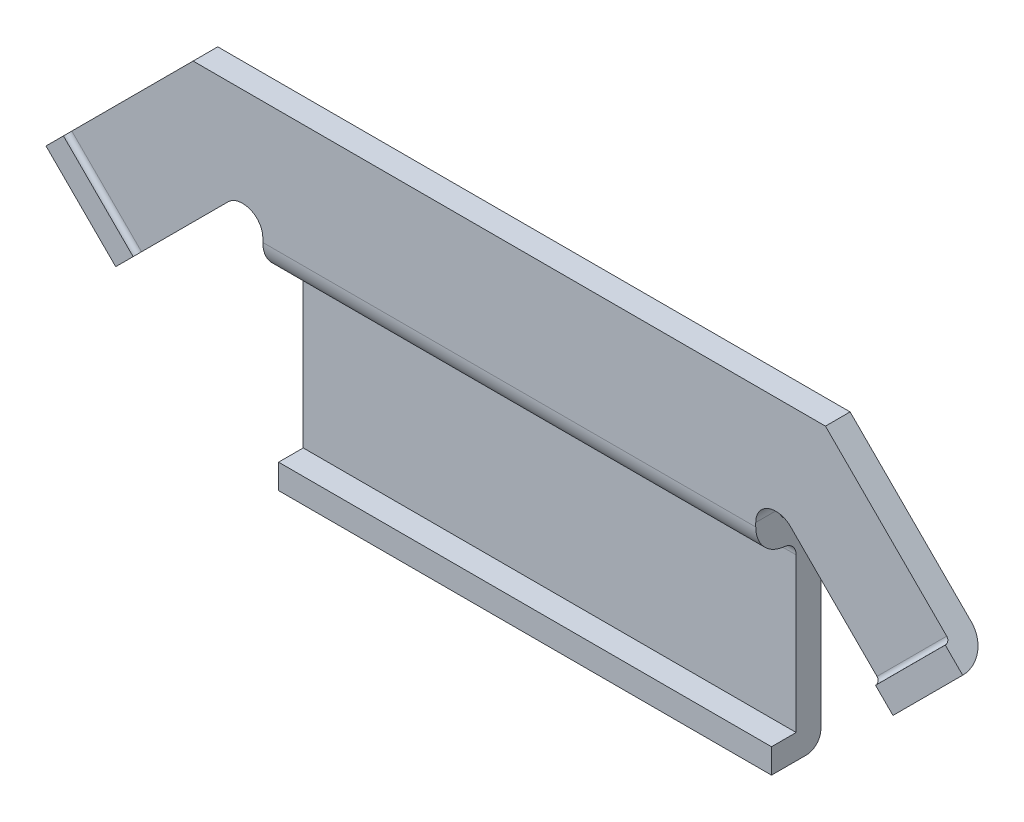
ISO-10303-21;
HEADER;
FILE_DESCRIPTION(('STEP AP214'),'2;1');
FILE_NAME('part.step','',(''),(''),'','','');
FILE_SCHEMA(('AUTOMOTIVE_DESIGN { 1 0 10303 214 1 1 1 1 }'));
ENDSEC;
DATA;
#1=APPLICATION_CONTEXT('core data for automotive mechanical design processes');
#2=APPLICATION_PROTOCOL_DEFINITION('international standard','automotive_design',2000,#1);
#3=PRODUCT_CONTEXT('',#1,'mechanical');
#4=PRODUCT('Part','Part','',(#3));
#5=PRODUCT_RELATED_PRODUCT_CATEGORY('part','',(#4));
#6=PRODUCT_DEFINITION_FORMATION('','',#4);
#7=PRODUCT_DEFINITION_CONTEXT('part definition',#1,'design');
#8=PRODUCT_DEFINITION('design','',#6,#7);
#9=PRODUCT_DEFINITION_SHAPE('','',#8);
#10=(LENGTH_UNIT() NAMED_UNIT(*) SI_UNIT(.MILLI.,.METRE.));
#11=(NAMED_UNIT(*) PLANE_ANGLE_UNIT() SI_UNIT($,.RADIAN.));
#12=(NAMED_UNIT(*) SI_UNIT($,.STERADIAN.) SOLID_ANGLE_UNIT());
#13=UNCERTAINTY_MEASURE_WITH_UNIT(LENGTH_MEASURE(1.E-05),#10,'distance_accuracy_value','');
#14=(GEOMETRIC_REPRESENTATION_CONTEXT(3) GLOBAL_UNCERTAINTY_ASSIGNED_CONTEXT((#13)) GLOBAL_UNIT_ASSIGNED_CONTEXT((#10,
#11,#12)) REPRESENTATION_CONTEXT('',''));
#15=CARTESIAN_POINT('',(0.,0.,0.));
#16=DIRECTION('',(0.,0.,1.));
#17=DIRECTION('',(1.,0.,0.));
#18=AXIS2_PLACEMENT_3D('',#15,#16,#17);
#19=CARTESIAN_POINT('',(2.5,-5.85,-0.26));
#20=DIRECTION('',(1.,0.,0.));
#21=DIRECTION('',(0.,0.,-1.));
#22=AXIS2_PLACEMENT_3D('',#19,#20,#21);
#23=CYLINDRICAL_SURFACE('',#22,0.15);
#24=CARTESIAN_POINT('',(-2.5,-5.85,-0.26));
#25=DIRECTION('',(1.,0.,0.));
#26=DIRECTION('',(0.,0.,-1.));
#27=AXIS2_PLACEMENT_3D('',#24,#25,#26);
#28=CIRCLE('',#27,0.15);
#29=CARTESIAN_POINT('',(-2.5,-6.,-0.26));
#30=VERTEX_POINT('',#29);
#31=CARTESIAN_POINT('',(-2.5,-5.85,-0.409999999999997));
#32=VERTEX_POINT('',#31);
#33=EDGE_CURVE('E176',#30,#32,#28,.T.);
#34=ORIENTED_EDGE('',*,*,#33,.T.);
#35=DIRECTION('',(1.,0.,0.));
#36=VECTOR('',#35,1.);
#37=CARTESIAN_POINT('',(2.5,-5.85,-0.409999999999997));
#38=LINE('',#37,#36);
#39=CARTESIAN_POINT('',(2.5,-5.85,-0.409999999999997));
#40=VERTEX_POINT('',#39);
#41=EDGE_CURVE('E173',#40,#32,#38,.F.);
#42=ORIENTED_EDGE('',*,*,#41,.F.);
#43=CARTESIAN_POINT('',(2.5,-5.85,-0.26));
#44=DIRECTION('',(1.,0.,0.));
#45=DIRECTION('',(0.,0.,-1.));
#46=AXIS2_PLACEMENT_3D('',#43,#44,#45);
#47=CIRCLE('',#46,0.15);
#48=CARTESIAN_POINT('',(2.5,-6.,-0.26));
#49=VERTEX_POINT('',#48);
#50=EDGE_CURVE('E20',#40,#49,#47,.F.);
#51=ORIENTED_EDGE('',*,*,#50,.T.);
#52=DIRECTION('',(1.,0.,0.));
#53=VECTOR('',#52,1.);
#54=CARTESIAN_POINT('',(2.5,-6.,-0.26));
#55=LINE('',#54,#53);
#56=EDGE_CURVE('E172',#30,#49,#55,.T.);
#57=ORIENTED_EDGE('',*,*,#56,.F.);
#58=EDGE_LOOP('',(#34,#42,#51,#57));
#59=FACE_BOUND('',#58,.T.);
#60=ADVANCED_FACE('F17',(#59),#23,.T.);
#61=CARTESIAN_POINT('',(2.5,-6.,0.09));
#62=DIRECTION('',(0.,-1.,0.));
#63=DIRECTION('',(0.,0.,-1.));
#64=AXIS2_PLACEMENT_3D('',#61,#62,#63);
#65=PLANE('',#64);
#66=DIRECTION('',(0.,0.,-1.));
#67=VECTOR('',#66,1.);
#68=CARTESIAN_POINT('',(2.5,-6.,0.09));
#69=LINE('',#68,#67);
#70=CARTESIAN_POINT('',(2.5,-6.,0.09));
#71=VERTEX_POINT('',#70);
#72=EDGE_CURVE('E181',#49,#71,#69,.F.);
#73=ORIENTED_EDGE('',*,*,#72,.T.);
#74=DIRECTION('',(1.,0.,0.));
#75=VECTOR('',#74,1.);
#76=CARTESIAN_POINT('',(2.5,-6.,0.09));
#77=LINE('',#76,#75);
#78=CARTESIAN_POINT('',(-2.5,-6.,0.09));
#79=VERTEX_POINT('',#78);
#80=EDGE_CURVE('E288',#79,#71,#77,.T.);
#81=ORIENTED_EDGE('',*,*,#80,.F.);
#82=DIRECTION('',(0.,0.,-1.));
#83=VECTOR('',#82,1.);
#84=CARTESIAN_POINT('',(-2.5,-6.,0.09));
#85=LINE('',#84,#83);
#86=EDGE_CURVE('E184',#79,#30,#85,.T.);
#87=ORIENTED_EDGE('',*,*,#86,.T.);
#88=ORIENTED_EDGE('',*,*,#56,.T.);
#89=EDGE_LOOP('',(#73,#81,#87,#88));
#90=FACE_BOUND('',#89,.T.);
#91=ADVANCED_FACE('F179',(#90),#65,.T.);
#92=CARTESIAN_POINT('',(2.5,-4.19,-0.41));
#93=DIRECTION('',(0.,0.,-1.));
#94=DIRECTION('',(0.,1.,0.));
#95=AXIS2_PLACEMENT_3D('',#92,#93,#94);
#96=PLANE('',#95);
#97=DIRECTION('',(0.,1.,0.));
#98=VECTOR('',#97,1.);
#99=CARTESIAN_POINT('',(-2.5,-4.19,-0.41));
#100=LINE('',#99,#98);
#101=CARTESIAN_POINT('',(-2.5,-4.19,-0.41000000000011));
#102=VERTEX_POINT('',#101);
#103=EDGE_CURVE('E200',#32,#102,#100,.T.);
#104=ORIENTED_EDGE('',*,*,#103,.T.);
#105=DIRECTION('',(1.,0.,0.));
#106=VECTOR('',#105,1.);
#107=CARTESIAN_POINT('',(2.5,-4.19,-0.41000000000022));
#108=LINE('',#107,#106);
#109=CARTESIAN_POINT('',(2.5,-4.19,-0.41000000000011));
#110=VERTEX_POINT('',#109);
#111=EDGE_CURVE('E303',#110,#102,#108,.F.);
#112=ORIENTED_EDGE('',*,*,#111,.F.);
#113=DIRECTION('',(0.,1.,0.));
#114=VECTOR('',#113,1.);
#115=CARTESIAN_POINT('',(2.5,-4.19,-0.41));
#116=LINE('',#115,#114);
#117=EDGE_CURVE('E165',#110,#40,#116,.F.);
#118=ORIENTED_EDGE('',*,*,#117,.T.);
#119=ORIENTED_EDGE('',*,*,#41,.T.);
#120=EDGE_LOOP('',(#104,#112,#118,#119));
#121=FACE_BOUND('',#120,.T.);
#122=ADVANCED_FACE('F620',(#121),#96,.T.);
#123=CARTESIAN_POINT('',(2.5,-5.75,0.09));
#124=DIRECTION('',(0.,0.,1.));
#125=DIRECTION('',(0.,-1.,0.));
#126=AXIS2_PLACEMENT_3D('',#123,#124,#125);
#127=PLANE('',#126);
#128=DIRECTION('',(0.,-1.,0.));
#129=VECTOR('',#128,1.);
#130=CARTESIAN_POINT('',(2.5,-5.75,0.09));
#131=LINE('',#130,#129);
#132=CARTESIAN_POINT('',(2.5,-5.75,0.09));
#133=VERTEX_POINT('',#132);
#134=EDGE_CURVE('E191',#71,#133,#131,.F.);
#135=ORIENTED_EDGE('',*,*,#134,.T.);
#136=DIRECTION('',(1.,0.,0.));
#137=VECTOR('',#136,1.);
#138=CARTESIAN_POINT('',(2.5,-5.75,0.09));
#139=LINE('',#138,#137);
#140=CARTESIAN_POINT('',(-2.5,-5.75,0.09));
#141=VERTEX_POINT('',#140);
#142=EDGE_CURVE('E317',#141,#133,#139,.T.);
#143=ORIENTED_EDGE('',*,*,#142,.F.);
#144=DIRECTION('',(0.,-1.,0.));
#145=VECTOR('',#144,1.);
#146=CARTESIAN_POINT('',(-2.5,-3.7,0.09));
#147=LINE('',#146,#145);
#148=EDGE_CURVE('E283',#79,#141,#147,.F.);
#149=ORIENTED_EDGE('',*,*,#148,.F.);
#150=ORIENTED_EDGE('',*,*,#80,.T.);
#151=EDGE_LOOP('',(#135,#143,#149,#150));
#152=FACE_BOUND('',#151,.T.);
#153=ADVANCED_FACE('F616',(#152),#127,.T.);
#154=CARTESIAN_POINT('',(2.5,-4.19,-0.02645889627922));
#155=DIRECTION('',(1.,0.,0.));
#156=DIRECTION('',(0.,0.,-1.));
#157=AXIS2_PLACEMENT_3D('',#154,#155,#156);
#158=CYLINDRICAL_SURFACE('',#157,0.383541103721);
#159=CARTESIAN_POINT('',(2.5,-4.19,-0.02645889627922));
#160=DIRECTION('',(1.,0.,0.));
#161=DIRECTION('',(0.,0.,-1.));
#162=AXIS2_PLACEMENT_3D('',#159,#160,#161);
#163=CIRCLE('',#162,0.383541103721);
#164=CARTESIAN_POINT('',(2.5,-3.80811476720721,-0.0620601212333258));
#165=VERTEX_POINT('',#164);
#166=EDGE_CURVE('E270',#110,#165,#163,.T.);
#167=ORIENTED_EDGE('',*,*,#166,.F.);
#168=ORIENTED_EDGE('',*,*,#111,.T.);
#169=CARTESIAN_POINT('',(-2.5,-4.19,-0.02645889627922));
#170=DIRECTION('',(1.,0.,0.));
#171=DIRECTION('',(0.,0.,-1.));
#172=AXIS2_PLACEMENT_3D('',#169,#170,#171);
#173=CIRCLE('',#172,0.383541103721);
#174=CARTESIAN_POINT('',(-2.5,-3.80811476720721,-0.0620601212333258));
#175=VERTEX_POINT('',#174);
#176=EDGE_CURVE('E284',#175,#102,#173,.F.);
#177=ORIENTED_EDGE('',*,*,#176,.F.);
#178=DIRECTION('',(1.,0.,0.));
#179=VECTOR('',#178,1.);
#180=CARTESIAN_POINT('',(2.5,-3.80811476720731,-0.062060121233301));
#181=LINE('',#180,#179);
#182=EDGE_CURVE('E269',#175,#165,#181,.T.);
#183=ORIENTED_EDGE('',*,*,#182,.T.);
#184=EDGE_LOOP('',(#167,#168,#177,#183));
#185=FACE_BOUND('',#184,.T.);
#186=ADVANCED_FACE('F613',(#185),#158,.T.);
#187=CARTESIAN_POINT('',(-2.5,-3.7,0.));
#188=DIRECTION('',(-1.,0.,0.));
#189=DIRECTION('',(0.,-1.,0.));
#190=AXIS2_PLACEMENT_3D('',#187,#188,#189);
#191=PLANE('',#190);
#192=CARTESIAN_POINT('',(-2.5,-4.19,-0.02645889627922));
#193=DIRECTION('',(1.,0.,0.));
#194=DIRECTION('',(0.,0.,-1.));
#195=AXIS2_PLACEMENT_3D('',#192,#193,#194);
#196=CIRCLE('',#195,0.133541103721);
#197=CARTESIAN_POINT('',(-2.5,-4.19,-0.16000000000011));
#198=VERTEX_POINT('',#197);
#199=CARTESIAN_POINT('',(-2.5,-4.05703543639211,-0.0388545087131026));
#200=VERTEX_POINT('',#199);
#201=EDGE_CURVE('E281',#198,#200,#196,.T.);
#202=ORIENTED_EDGE('',*,*,#201,.T.);
#203=CARTESIAN_POINT('',(-2.5,-3.74,-0.06841011579141));
#204=DIRECTION('',(1.,0.,0.));
#205=DIRECTION('',(0.,0.,-1.));
#206=AXIS2_PLACEMENT_3D('',#203,#204,#205);
#207=CIRCLE('',#206,0.318410115791);
#208=CARTESIAN_POINT('',(-2.5,-3.74,0.25));
#209=VERTEX_POINT('',#208);
#210=EDGE_CURVE('E278',#200,#209,#207,.F.);
#211=ORIENTED_EDGE('',*,*,#210,.T.);
#212=DIRECTION('',(0.,-1.,0.));
#213=VECTOR('',#212,1.);
#214=CARTESIAN_POINT('',(-2.5,-3.7,0.25));
#215=LINE('',#214,#213);
#216=CARTESIAN_POINT('',(-2.5,-3.7,0.25));
#217=VERTEX_POINT('',#216);
#218=EDGE_CURVE('E292',#209,#217,#215,.F.);
#219=ORIENTED_EDGE('',*,*,#218,.T.);
#220=DIRECTION('',(0.,0.,1.));
#221=VECTOR('',#220,1.);
#222=CARTESIAN_POINT('',(-2.5,-3.7,0.));
#223=LINE('',#222,#221);
#224=CARTESIAN_POINT('',(-2.5,-3.7,0.));
#225=VERTEX_POINT('',#224);
#226=EDGE_CURVE('E290',#217,#225,#223,.F.);
#227=ORIENTED_EDGE('',*,*,#226,.T.);
#228=DIRECTION('',(0.,-1.,0.));
#229=VECTOR('',#228,1.);
#230=CARTESIAN_POINT('',(-2.5,-3.7,0.));
#231=LINE('',#230,#229);
#232=CARTESIAN_POINT('',(-2.5,-3.74,0.));
#233=VERTEX_POINT('',#232);
#234=EDGE_CURVE('E286',#225,#233,#231,.T.);
#235=ORIENTED_EDGE('',*,*,#234,.T.);
#236=CARTESIAN_POINT('',(-2.5,-3.74,-0.06841011579141));
#237=DIRECTION('',(1.,0.,0.));
#238=DIRECTION('',(0.,0.,-1.));
#239=AXIS2_PLACEMENT_3D('',#236,#237,#238);
#240=CIRCLE('',#239,0.06841011579141);
#241=EDGE_CURVE('E262',#233,#175,#240,.T.);
#242=ORIENTED_EDGE('',*,*,#241,.T.);
#243=ORIENTED_EDGE('',*,*,#176,.T.);
#244=ORIENTED_EDGE('',*,*,#103,.F.);
#245=ORIENTED_EDGE('',*,*,#33,.F.);
#246=ORIENTED_EDGE('',*,*,#86,.F.);
#247=ORIENTED_EDGE('',*,*,#148,.T.);
#248=DIRECTION('',(0.,0.,1.));
#249=VECTOR('',#248,1.);
#250=CARTESIAN_POINT('',(-2.5,-5.75,-0.16));
#251=LINE('',#250,#249);
#252=CARTESIAN_POINT('',(-2.5,-5.75,-0.159999999999997));
#253=VERTEX_POINT('',#252);
#254=EDGE_CURVE('E280',#253,#141,#251,.T.);
#255=ORIENTED_EDGE('',*,*,#254,.F.);
#256=DIRECTION('',(0.,-1.,0.));
#257=VECTOR('',#256,1.);
#258=CARTESIAN_POINT('',(-2.5,-4.19,-0.16));
#259=LINE('',#258,#257);
#260=EDGE_CURVE('E265',#198,#253,#259,.T.);
#261=ORIENTED_EDGE('',*,*,#260,.F.);
#262=EDGE_LOOP('',(#202,#211,#219,#227,#235,#242,#243,#244,#245,#246,#247,#255,#261));
#263=FACE_BOUND('',#262,.T.);
#264=ADVANCED_FACE('F471',(#263),#191,.T.);
#265=CARTESIAN_POINT('',(2.5,-5.75,-0.16));
#266=DIRECTION('',(0.,1.,0.));
#267=DIRECTION('',(0.,0.,1.));
#268=AXIS2_PLACEMENT_3D('',#265,#266,#267);
#269=PLANE('',#268);
#270=DIRECTION('',(0.,0.,1.));
#271=VECTOR('',#270,1.);
#272=CARTESIAN_POINT('',(2.5,-5.75,0.25));
#273=LINE('',#272,#271);
#274=CARTESIAN_POINT('',(2.5,-5.75,-0.159999999999997));
#275=VERTEX_POINT('',#274);
#276=EDGE_CURVE('E272',#275,#133,#273,.T.);
#277=ORIENTED_EDGE('',*,*,#276,.F.);
#278=DIRECTION('',(1.,0.,0.));
#279=VECTOR('',#278,1.);
#280=CARTESIAN_POINT('',(2.5,-5.75,-0.159999999999997));
#281=LINE('',#280,#279);
#282=EDGE_CURVE('E333',#253,#275,#281,.T.);
#283=ORIENTED_EDGE('',*,*,#282,.F.);
#284=ORIENTED_EDGE('',*,*,#254,.T.);
#285=ORIENTED_EDGE('',*,*,#142,.T.);
#286=EDGE_LOOP('',(#277,#283,#284,#285));
#287=FACE_BOUND('',#286,.T.);
#288=ADVANCED_FACE('F607',(#287),#269,.T.);
#289=CARTESIAN_POINT('',(2.5,-3.7,0.25));
#290=DIRECTION('',(1.,0.,0.));
#291=DIRECTION('',(0.,1.,0.));
#292=AXIS2_PLACEMENT_3D('',#289,#290,#291);
#293=PLANE('',#292);
#294=ORIENTED_EDGE('',*,*,#166,.T.);
#295=CARTESIAN_POINT('',(2.5,-3.74,-0.06841011579141));
#296=DIRECTION('',(1.,0.,0.));
#297=DIRECTION('',(0.,0.,-1.));
#298=AXIS2_PLACEMENT_3D('',#295,#296,#297);
#299=CIRCLE('',#298,0.06841011579141);
#300=CARTESIAN_POINT('',(2.5,-3.74,0.));
#301=VERTEX_POINT('',#300);
#302=EDGE_CURVE('E266',#165,#301,#299,.F.);
#303=ORIENTED_EDGE('',*,*,#302,.T.);
#304=DIRECTION('',(0.,1.,0.));
#305=VECTOR('',#304,1.);
#306=CARTESIAN_POINT('',(2.5,-3.7,0.));
#307=LINE('',#306,#305);
#308=CARTESIAN_POINT('',(2.5,-3.7,0.));
#309=VERTEX_POINT('',#308);
#310=EDGE_CURVE('E307',#301,#309,#307,.T.);
#311=ORIENTED_EDGE('',*,*,#310,.T.);
#312=DIRECTION('',(0.,0.,1.));
#313=VECTOR('',#312,1.);
#314=CARTESIAN_POINT('',(2.5,-3.7,0.25));
#315=LINE('',#314,#313);
#316=CARTESIAN_POINT('',(2.5,-3.7,0.25));
#317=VERTEX_POINT('',#316);
#318=EDGE_CURVE('E304',#309,#317,#315,.T.);
#319=ORIENTED_EDGE('',*,*,#318,.T.);
#320=DIRECTION('',(0.,1.,0.));
#321=VECTOR('',#320,1.);
#322=CARTESIAN_POINT('',(2.5,-3.7,0.25));
#323=LINE('',#322,#321);
#324=CARTESIAN_POINT('',(2.5,-3.74,0.25));
#325=VERTEX_POINT('',#324);
#326=EDGE_CURVE('E277',#317,#325,#323,.F.);
#327=ORIENTED_EDGE('',*,*,#326,.T.);
#328=CARTESIAN_POINT('',(2.5,-3.74,-0.06841011579141));
#329=DIRECTION('',(1.,0.,0.));
#330=DIRECTION('',(0.,0.,-1.));
#331=AXIS2_PLACEMENT_3D('',#328,#329,#330);
#332=CIRCLE('',#331,0.318410115791);
#333=CARTESIAN_POINT('',(2.5,-4.05703543639201,-0.0388545087131116));
#334=VERTEX_POINT('',#333);
#335=EDGE_CURVE('E275',#325,#334,#332,.T.);
#336=ORIENTED_EDGE('',*,*,#335,.T.);
#337=CARTESIAN_POINT('',(2.5,-4.19,-0.02645889627922));
#338=DIRECTION('',(1.,0.,0.));
#339=DIRECTION('',(0.,0.,-1.));
#340=AXIS2_PLACEMENT_3D('',#337,#338,#339);
#341=CIRCLE('',#340,0.133541103721);
#342=CARTESIAN_POINT('',(2.5,-4.19,-0.16000000000011));
#343=VERTEX_POINT('',#342);
#344=EDGE_CURVE('E273',#334,#343,#341,.F.);
#345=ORIENTED_EDGE('',*,*,#344,.T.);
#346=DIRECTION('',(0.,-1.,0.));
#347=VECTOR('',#346,1.);
#348=CARTESIAN_POINT('',(2.5,-4.19,-0.16));
#349=LINE('',#348,#347);
#350=EDGE_CURVE('E342',#275,#343,#349,.F.);
#351=ORIENTED_EDGE('',*,*,#350,.F.);
#352=ORIENTED_EDGE('',*,*,#276,.T.);
#353=ORIENTED_EDGE('',*,*,#134,.F.);
#354=ORIENTED_EDGE('',*,*,#72,.F.);
#355=ORIENTED_EDGE('',*,*,#50,.F.);
#356=ORIENTED_EDGE('',*,*,#117,.F.);
#357=EDGE_LOOP('',(#294,#303,#311,#319,#327,#336,#345,#351,#352,#353,#354,#355,#356));
#358=FACE_BOUND('',#357,.T.);
#359=ADVANCED_FACE('F188',(#358),#293,.T.);
#360=CARTESIAN_POINT('',(2.5,-3.74,-0.06841011579141));
#361=DIRECTION('',(1.,0.,0.));
#362=DIRECTION('',(0.,0.,-1.));
#363=AXIS2_PLACEMENT_3D('',#360,#361,#362);
#364=CYLINDRICAL_SURFACE('',#363,0.06841011579141);
#365=DIRECTION('',(-1.,0.,0.));
#366=VECTOR('',#365,1.);
#367=CARTESIAN_POINT('',(3.207106781187,-3.74,0.));
#368=LINE('',#367,#366);
#369=EDGE_CURVE('E254',#301,#233,#368,.T.);
#370=ORIENTED_EDGE('',*,*,#369,.F.);
#371=ORIENTED_EDGE('',*,*,#302,.F.);
#372=ORIENTED_EDGE('',*,*,#182,.F.);
#373=ORIENTED_EDGE('',*,*,#241,.F.);
#374=EDGE_LOOP('',(#370,#371,#372,#373));
#375=FACE_BOUND('',#374,.T.);
#376=ADVANCED_FACE('F600',(#375),#364,.F.);
#377=CARTESIAN_POINT('',(2.5,-4.19,-0.16));
#378=DIRECTION('',(0.,0.,1.));
#379=DIRECTION('',(0.,-1.,0.));
#380=AXIS2_PLACEMENT_3D('',#377,#378,#379);
#381=PLANE('',#380);
#382=ORIENTED_EDGE('',*,*,#350,.T.);
#383=DIRECTION('',(1.,0.,0.));
#384=VECTOR('',#383,1.);
#385=CARTESIAN_POINT('',(2.5,-4.19,-0.16000000000022));
#386=LINE('',#385,#384);
#387=EDGE_CURVE('E351',#343,#198,#386,.F.);
#388=ORIENTED_EDGE('',*,*,#387,.T.);
#389=ORIENTED_EDGE('',*,*,#260,.T.);
#390=ORIENTED_EDGE('',*,*,#282,.T.);
#391=EDGE_LOOP('',(#382,#388,#389,#390));
#392=FACE_BOUND('',#391,.T.);
#393=ADVANCED_FACE('F596',(#392),#381,.T.);
#394=CARTESIAN_POINT('',(3.207106781187,-2.5,0.));
#395=DIRECTION('',(0.,0.,-1.));
#396=DIRECTION('',(-1.,0.,0.));
#397=AXIS2_PLACEMENT_3D('',#394,#395,#396);
#398=PLANE('',#397);
#399=DIRECTION('',(-1.,0.,0.));
#400=VECTOR('',#399,1.);
#401=CARTESIAN_POINT('',(3.207106781187,-3.5,0.));
#402=LINE('',#401,#400);
#403=CARTESIAN_POINT('',(-2.7,-3.5,0.));
#404=VERTEX_POINT('',#403);
#405=CARTESIAN_POINT('',(-2.710050506339,-3.5,0.));
#406=VERTEX_POINT('',#405);
#407=EDGE_CURVE('E251',#404,#406,#402,.T.);
#408=ORIENTED_EDGE('',*,*,#407,.T.);
#409=CARTESIAN_POINT('',(-2.710050506339,-3.7,0.));
#410=DIRECTION('',(0.,0.,-1.));
#411=DIRECTION('',(-1.,0.,0.));
#412=AXIS2_PLACEMENT_3D('',#409,#410,#411);
#413=CIRCLE('',#412,0.2);
#414=CARTESIAN_POINT('',(-2.851471862576,-3.558578643763,0.));
#415=VERTEX_POINT('',#414);
#416=EDGE_CURVE('E248',#406,#415,#413,.F.);
#417=ORIENTED_EDGE('',*,*,#416,.T.);
#418=DIRECTION('',(-0.707106781186548,-0.707106781186547,0.));
#419=VECTOR('',#418,1.);
#420=CARTESIAN_POINT('',(-2.851471862576,-3.558578643763,0.));
#421=LINE('',#420,#419);
#422=CARTESIAN_POINT('',(-3.729988270759,-4.437095051946,0.));
#423=VERTEX_POINT('',#422);
#424=EDGE_CURVE('E350',#415,#423,#421,.T.);
#425=ORIENTED_EDGE('',*,*,#424,.T.);
#426=DIRECTION('',(0.707106781186548,-0.707106781186548,0.));
#427=VECTOR('',#426,1.);
#428=CARTESIAN_POINT('',(-3.729988270759,-4.437095051946,0.));
#429=LINE('',#428,#427);
#430=CARTESIAN_POINT('',(-4.437095051946,-3.729988270759,0.));
#431=VERTEX_POINT('',#430);
#432=EDGE_CURVE('E354',#431,#423,#429,.T.);
#433=ORIENTED_EDGE('',*,*,#432,.F.);
#434=DIRECTION('',(-0.707106781186548,-0.707106781186548,0.));
#435=VECTOR('',#434,1.);
#436=CARTESIAN_POINT('',(-3.207106781187,-2.5,0.));
#437=LINE('',#436,#435);
#438=CARTESIAN_POINT('',(-3.207106781187,-2.5,0.));
#439=VERTEX_POINT('',#438);
#440=EDGE_CURVE('E247',#439,#431,#437,.T.);
#441=ORIENTED_EDGE('',*,*,#440,.F.);
#442=DIRECTION('',(-1.,0.,0.));
#443=VECTOR('',#442,1.);
#444=CARTESIAN_POINT('',(3.207106781187,-2.5,0.));
#445=LINE('',#444,#443);
#446=CARTESIAN_POINT('',(3.207106781187,-2.5,0.));
#447=VERTEX_POINT('',#446);
#448=EDGE_CURVE('E364',#447,#439,#445,.T.);
#449=ORIENTED_EDGE('',*,*,#448,.F.);
#450=DIRECTION('',(-0.707106781186548,0.707106781186548,0.));
#451=VECTOR('',#450,1.);
#452=CARTESIAN_POINT('',(3.207106781187,-2.5,0.));
#453=LINE('',#452,#451);
#454=CARTESIAN_POINT('',(4.437095051946,-3.729988270759,0.));
#455=VERTEX_POINT('',#454);
#456=EDGE_CURVE('E242',#455,#447,#453,.T.);
#457=ORIENTED_EDGE('',*,*,#456,.F.);
#458=DIRECTION('',(-0.707106781186548,-0.707106781186548,0.));
#459=VECTOR('',#458,1.);
#460=CARTESIAN_POINT('',(3.729988270759,-4.437095051946,0.));
#461=LINE('',#460,#459);
#462=CARTESIAN_POINT('',(3.729988270759,-4.437095051946,0.));
#463=VERTEX_POINT('',#462);
#464=EDGE_CURVE('E250',#463,#455,#461,.F.);
#465=ORIENTED_EDGE('',*,*,#464,.F.);
#466=DIRECTION('',(-0.707106781186548,0.707106781186547,0.));
#467=VECTOR('',#466,1.);
#468=CARTESIAN_POINT('',(3.729988270759,-4.437095051946,0.));
#469=LINE('',#468,#467);
#470=CARTESIAN_POINT('',(2.85147186257616,-3.55857864376285,0.));
#471=VERTEX_POINT('',#470);
#472=EDGE_CURVE('E261',#463,#471,#469,.T.);
#473=ORIENTED_EDGE('',*,*,#472,.T.);
#474=CARTESIAN_POINT('',(2.710050506339,-3.7,0.));
#475=DIRECTION('',(0.,0.,-1.));
#476=DIRECTION('',(-1.,0.,0.));
#477=AXIS2_PLACEMENT_3D('',#474,#475,#476);
#478=CIRCLE('',#477,0.2);
#479=CARTESIAN_POINT('',(2.710050506339,-3.5,0.));
#480=VERTEX_POINT('',#479);
#481=EDGE_CURVE('E259',#471,#480,#478,.F.);
#482=ORIENTED_EDGE('',*,*,#481,.T.);
#483=DIRECTION('',(-1.,0.,0.));
#484=VECTOR('',#483,1.);
#485=CARTESIAN_POINT('',(3.207106781187,-3.5,0.));
#486=LINE('',#485,#484);
#487=CARTESIAN_POINT('',(2.7,-3.5,0.));
#488=VERTEX_POINT('',#487);
#489=EDGE_CURVE('E258',#480,#488,#486,.T.);
#490=ORIENTED_EDGE('',*,*,#489,.T.);
#491=CARTESIAN_POINT('',(2.7,-3.7,0.));
#492=DIRECTION('',(0.,0.,-1.));
#493=DIRECTION('',(-1.,0.,0.));
#494=AXIS2_PLACEMENT_3D('',#491,#492,#493);
#495=CIRCLE('',#494,0.2);
#496=EDGE_CURVE('E255',#488,#309,#495,.F.);
#497=ORIENTED_EDGE('',*,*,#496,.T.);
#498=ORIENTED_EDGE('',*,*,#310,.F.);
#499=ORIENTED_EDGE('',*,*,#369,.T.);
#500=ORIENTED_EDGE('',*,*,#234,.F.);
#501=CARTESIAN_POINT('',(-2.7,-3.7,0.));
#502=DIRECTION('',(0.,0.,1.));
#503=DIRECTION('',(1.,0.,0.));
#504=AXIS2_PLACEMENT_3D('',#501,#502,#503);
#505=CIRCLE('',#504,0.2);
#506=EDGE_CURVE('E252',#225,#404,#505,.T.);
#507=ORIENTED_EDGE('',*,*,#506,.T.);
#508=EDGE_LOOP('',(#408,#417,#425,#433,#441,#449,#457,#465,#473,#482,#490,#497,#498,#499,#500,#507));
#509=FACE_BOUND('',#508,.T.);
#510=ADVANCED_FACE('F592',(#509),#398,.T.);
#511=CARTESIAN_POINT('',(3.729988270759,-4.437095051946,0.3));
#512=DIRECTION('',(-0.707106781186548,-0.707106781186548,0.));
#513=DIRECTION('',(0.707106781186548,-0.707106781186548,0.));
#514=AXIS2_PLACEMENT_3D('',#511,#512,#513);
#515=CYLINDRICAL_SURFACE('',#514,0.3);
#516=CARTESIAN_POINT('',(3.729988270759,-4.437095051946,0.3));
#517=DIRECTION('',(-0.707106781186548,-0.707106781186548,0.));
#518=DIRECTION('',(0.707106781186548,-0.707106781186548,0.));
#519=AXIS2_PLACEMENT_3D('',#516,#517,#518);
#520=CIRCLE('',#519,0.3);
#521=CARTESIAN_POINT('',(3.94212030511498,-4.64922708630198,0.3));
#522=VERTEX_POINT('',#521);
#523=EDGE_CURVE('E233',#463,#522,#520,.T.);
#524=ORIENTED_EDGE('',*,*,#523,.F.);
#525=ORIENTED_EDGE('',*,*,#464,.T.);
#526=CARTESIAN_POINT('',(4.437095051946,-3.729988270759,0.3));
#527=DIRECTION('',(-0.707106781186548,-0.707106781186548,0.));
#528=DIRECTION('',(0.707106781186548,-0.707106781186548,0.));
#529=AXIS2_PLACEMENT_3D('',#526,#527,#528);
#530=CIRCLE('',#529,0.3);
#531=CARTESIAN_POINT('',(4.64922708630198,-3.94212030511498,0.3));
#532=VERTEX_POINT('',#531);
#533=EDGE_CURVE('E239',#532,#455,#530,.F.);
#534=ORIENTED_EDGE('',*,*,#533,.F.);
#535=DIRECTION('',(-0.707106781186547,-0.707106781186547,0.));
#536=VECTOR('',#535,1.);
#537=CARTESIAN_POINT('',(4.649227086302,-3.942120305115,0.3));
#538=LINE('',#537,#536);
#539=EDGE_CURVE('E355',#532,#522,#538,.T.);
#540=ORIENTED_EDGE('',*,*,#539,.T.);
#541=EDGE_LOOP('',(#524,#525,#534,#540));
#542=FACE_BOUND('',#541,.T.);
#543=ADVANCED_FACE('F588',(#542),#515,.T.);
#544=CARTESIAN_POINT('',(3.942120305115,-4.649227086302,0.3));
#545=DIRECTION('',(0.,0.,-1.));
#546=DIRECTION('',(-1.,0.,0.));
#547=AXIS2_PLACEMENT_3D('',#544,#545,#546);
#548=PLANE('',#547);
#549=DIRECTION('',(-0.707106781186548,-0.707106781186548,0.));
#550=VECTOR('',#549,1.);
#551=CARTESIAN_POINT('',(3.76534360981833,-4.47245039100533,0.3));
#552=LINE('',#551,#550);
#553=CARTESIAN_POINT('',(4.47245039100533,-3.76534360981833,0.3));
#554=VERTEX_POINT('',#553);
#555=CARTESIAN_POINT('',(3.76534360981833,-4.47245039100533,0.3));
#556=VERTEX_POINT('',#555);
#557=EDGE_CURVE('E238',#554,#556,#552,.T.);
#558=ORIENTED_EDGE('',*,*,#557,.T.);
#559=DIRECTION('',(0.707106781186548,-0.707106781186548,0.));
#560=VECTOR('',#559,1.);
#561=CARTESIAN_POINT('',(4.267766952966,-4.974873734153,0.3));
#562=LINE('',#561,#560);
#563=EDGE_CURVE('E232',#522,#556,#562,.F.);
#564=ORIENTED_EDGE('',*,*,#563,.F.);
#565=ORIENTED_EDGE('',*,*,#539,.F.);
#566=DIRECTION('',(-0.707106781186548,0.707106781186548,0.));
#567=VECTOR('',#566,1.);
#568=CARTESIAN_POINT('',(3.207106781187,-2.5,0.3));
#569=LINE('',#568,#567);
#570=EDGE_CURVE('E243',#554,#532,#569,.F.);
#571=ORIENTED_EDGE('',*,*,#570,.F.);
#572=EDGE_LOOP('',(#558,#564,#565,#571));
#573=FACE_BOUND('',#572,.T.);
#574=ADVANCED_FACE('F584',(#573),#548,.F.);
#575=CARTESIAN_POINT('',(2.5,-4.19,-0.02645889627922));
#576=DIRECTION('',(1.,0.,0.));
#577=DIRECTION('',(0.,0.,-1.));
#578=AXIS2_PLACEMENT_3D('',#575,#576,#577);
#579=CYLINDRICAL_SURFACE('',#578,0.133541103721);
#580=ORIENTED_EDGE('',*,*,#387,.F.);
#581=ORIENTED_EDGE('',*,*,#344,.F.);
#582=DIRECTION('',(1.,0.,0.));
#583=VECTOR('',#582,1.);
#584=CARTESIAN_POINT('',(2.5,-4.05703543639201,-0.0388545087130893));
#585=LINE('',#584,#583);
#586=EDGE_CURVE('E310',#200,#334,#585,.T.);
#587=ORIENTED_EDGE('',*,*,#586,.F.);
#588=ORIENTED_EDGE('',*,*,#201,.F.);
#589=EDGE_LOOP('',(#580,#581,#587,#588));
#590=FACE_BOUND('',#589,.T.);
#591=ADVANCED_FACE('F580',(#590),#579,.F.);
#592=CARTESIAN_POINT('',(-3.729988270759,-4.437095051946,0.3));
#593=DIRECTION('',(0.707106781186548,-0.707106781186548,0.));
#594=DIRECTION('',(0.707106781186548,0.707106781186548,0.));
#595=AXIS2_PLACEMENT_3D('',#592,#593,#594);
#596=CYLINDRICAL_SURFACE('',#595,0.3);
#597=CARTESIAN_POINT('',(-3.729988270759,-4.437095051946,0.3));
#598=DIRECTION('',(0.707106781186548,-0.707106781186548,0.));
#599=DIRECTION('',(0.707106781186548,0.707106781186548,0.));
#600=AXIS2_PLACEMENT_3D('',#597,#598,#599);
#601=CIRCLE('',#600,0.3);
#602=CARTESIAN_POINT('',(-3.94212030511498,-4.64922708630198,0.299999999999999));
#603=VERTEX_POINT('',#602);
#604=EDGE_CURVE('E225',#603,#423,#601,.T.);
#605=ORIENTED_EDGE('',*,*,#604,.F.);
#606=DIRECTION('',(-0.707106781186547,0.707106781186547,0.));
#607=VECTOR('',#606,1.);
#608=CARTESIAN_POINT('',(-3.942120305115,-4.649227086302,0.299999999999998));
#609=LINE('',#608,#607);
#610=CARTESIAN_POINT('',(-4.64922708630198,-3.94212030511498,0.3));
#611=VERTEX_POINT('',#610);
#612=EDGE_CURVE('E374',#603,#611,#609,.T.);
#613=ORIENTED_EDGE('',*,*,#612,.T.);
#614=CARTESIAN_POINT('',(-4.437095051946,-3.729988270759,0.3));
#615=DIRECTION('',(0.707106781186548,-0.707106781186548,0.));
#616=DIRECTION('',(0.707106781186548,0.707106781186548,0.));
#617=AXIS2_PLACEMENT_3D('',#614,#615,#616);
#618=CIRCLE('',#617,0.3);
#619=EDGE_CURVE('E244',#431,#611,#618,.F.);
#620=ORIENTED_EDGE('',*,*,#619,.F.);
#621=ORIENTED_EDGE('',*,*,#432,.T.);
#622=EDGE_LOOP('',(#605,#613,#620,#621));
#623=FACE_BOUND('',#622,.T.);
#624=ADVANCED_FACE('F576',(#623),#596,.T.);
#625=CARTESIAN_POINT('',(-3.765343609818,-4.472450391005,0.3));
#626=DIRECTION('',(0.,0.,-1.));
#627=DIRECTION('',(-1.,0.,0.));
#628=AXIS2_PLACEMENT_3D('',#625,#626,#627);
#629=PLANE('',#628);
#630=ORIENTED_EDGE('',*,*,#612,.F.);
#631=DIRECTION('',(0.707106781186548,0.707106781186548,0.));
#632=VECTOR('',#631,1.);
#633=CARTESIAN_POINT('',(-4.267766952966,-4.974873734153,0.3));
#634=LINE('',#633,#632);
#635=CARTESIAN_POINT('',(-3.76534360981833,-4.47245039100533,0.3));
#636=VERTEX_POINT('',#635);
#637=EDGE_CURVE('E228',#636,#603,#634,.F.);
#638=ORIENTED_EDGE('',*,*,#637,.F.);
#639=DIRECTION('',(0.707106781186548,-0.707106781186548,0.));
#640=VECTOR('',#639,1.);
#641=CARTESIAN_POINT('',(-3.76534360981833,-4.47245039100533,0.3));
#642=LINE('',#641,#640);
#643=CARTESIAN_POINT('',(-4.47245039100533,-3.76534360981833,0.3));
#644=VERTEX_POINT('',#643);
#645=EDGE_CURVE('E222',#636,#644,#642,.F.);
#646=ORIENTED_EDGE('',*,*,#645,.T.);
#647=DIRECTION('',(-0.707106781186548,-0.707106781186548,0.));
#648=VECTOR('',#647,1.);
#649=CARTESIAN_POINT('',(-3.207106781187,-2.5,0.3));
#650=LINE('',#649,#648);
#651=EDGE_CURVE('E246',#611,#644,#650,.F.);
#652=ORIENTED_EDGE('',*,*,#651,.F.);
#653=EDGE_LOOP('',(#630,#638,#646,#652));
#654=FACE_BOUND('',#653,.T.);
#655=ADVANCED_FACE('F573',(#654),#629,.F.);
#656=CARTESIAN_POINT('',(-3.207106781187,-2.5,0.25));
#657=DIRECTION('',(-0.707106781186548,0.707106781186548,0.));
#658=DIRECTION('',(-0.707106781186548,-0.707106781186548,0.));
#659=AXIS2_PLACEMENT_3D('',#656,#657,#658);
#660=PLANE('',#659);
#661=DIRECTION('',(0.707106781186547,0.707106781186548,0.));
#662=VECTOR('',#661,1.);
#663=CARTESIAN_POINT('',(-4.437095051946,-3.729988270759,0.25));
#664=LINE('',#663,#662);
#665=CARTESIAN_POINT('',(-4.437095051946,-3.729988270759,0.25));
#666=VERTEX_POINT('',#665);
#667=CARTESIAN_POINT('',(-3.207106781187,-2.5,0.25));
#668=VERTEX_POINT('',#667);
#669=EDGE_CURVE('E221',#666,#668,#664,.T.);
#670=ORIENTED_EDGE('',*,*,#669,.T.);
#671=DIRECTION('',(0.,0.,1.));
#672=VECTOR('',#671,1.);
#673=CARTESIAN_POINT('',(-3.207106781187,-2.5,0.25));
#674=LINE('',#673,#672);
#675=EDGE_CURVE('E367',#439,#668,#674,.T.);
#676=ORIENTED_EDGE('',*,*,#675,.F.);
#677=ORIENTED_EDGE('',*,*,#440,.T.);
#678=ORIENTED_EDGE('',*,*,#619,.T.);
#679=ORIENTED_EDGE('',*,*,#651,.T.);
#680=CARTESIAN_POINT('',(-4.437095051946,-3.729988270759,0.3));
#681=DIRECTION('',(0.707106781186548,-0.707106781186548,0.));
#682=DIRECTION('',(0.707106781186548,0.707106781186548,0.));
#683=AXIS2_PLACEMENT_3D('',#680,#681,#682);
#684=CIRCLE('',#683,0.05);
#685=EDGE_CURVE('E218',#644,#666,#684,.T.);
#686=ORIENTED_EDGE('',*,*,#685,.T.);
#687=EDGE_LOOP('',(#670,#676,#677,#678,#679,#686));
#688=FACE_BOUND('',#687,.T.);
#689=ADVANCED_FACE('F537',(#688),#660,.T.);
#690=CARTESIAN_POINT('',(3.207106781187,-2.5,0.25));
#691=DIRECTION('',(0.,1.,0.));
#692=DIRECTION('',(-1.,0.,0.));
#693=AXIS2_PLACEMENT_3D('',#690,#691,#692);
#694=PLANE('',#693);
#695=DIRECTION('',(-1.,0.,0.));
#696=VECTOR('',#695,1.);
#697=CARTESIAN_POINT('',(3.207106781187,-2.5,0.25));
#698=LINE('',#697,#696);
#699=CARTESIAN_POINT('',(3.207106781187,-2.5,0.25));
#700=VERTEX_POINT('',#699);
#701=EDGE_CURVE('E390',#668,#700,#698,.F.);
#702=ORIENTED_EDGE('',*,*,#701,.T.);
#703=DIRECTION('',(0.,0.,1.));
#704=VECTOR('',#703,1.);
#705=CARTESIAN_POINT('',(3.207106781187,-2.5,0.25));
#706=LINE('',#705,#704);
#707=EDGE_CURVE('E373',#447,#700,#706,.T.);
#708=ORIENTED_EDGE('',*,*,#707,.F.);
#709=ORIENTED_EDGE('',*,*,#448,.T.);
#710=ORIENTED_EDGE('',*,*,#675,.T.);
#711=EDGE_LOOP('',(#702,#708,#709,#710));
#712=FACE_BOUND('',#711,.T.);
#713=ADVANCED_FACE('F522',(#712),#694,.T.);
#714=CARTESIAN_POINT('',(3.207106781187,-2.5,0.25));
#715=DIRECTION('',(0.707106781186548,0.707106781186548,0.));
#716=DIRECTION('',(-0.707106781186548,0.707106781186548,0.));
#717=AXIS2_PLACEMENT_3D('',#714,#715,#716);
#718=PLANE('',#717);
#719=ORIENTED_EDGE('',*,*,#456,.T.);
#720=ORIENTED_EDGE('',*,*,#707,.T.);
#721=DIRECTION('',(0.707106781186547,-0.707106781186548,0.));
#722=VECTOR('',#721,1.);
#723=CARTESIAN_POINT('',(3.207106781187,-2.5,0.25));
#724=LINE('',#723,#722);
#725=CARTESIAN_POINT('',(4.437095051946,-3.729988270759,0.25));
#726=VERTEX_POINT('',#725);
#727=EDGE_CURVE('E399',#700,#726,#724,.T.);
#728=ORIENTED_EDGE('',*,*,#727,.T.);
#729=CARTESIAN_POINT('',(4.437095051946,-3.729988270759,0.3));
#730=DIRECTION('',(-0.707106781186548,-0.707106781186548,0.));
#731=DIRECTION('',(0.707106781186548,-0.707106781186548,0.));
#732=AXIS2_PLACEMENT_3D('',#729,#730,#731);
#733=CIRCLE('',#732,0.05);
#734=EDGE_CURVE('E235',#726,#554,#733,.T.);
#735=ORIENTED_EDGE('',*,*,#734,.T.);
#736=ORIENTED_EDGE('',*,*,#570,.T.);
#737=ORIENTED_EDGE('',*,*,#533,.T.);
#738=EDGE_LOOP('',(#719,#720,#728,#735,#736,#737));
#739=FACE_BOUND('',#738,.T.);
#740=ADVANCED_FACE('F515',(#739),#718,.T.);
#741=CARTESIAN_POINT('',(3.729988270759,-4.437095051946,0.3));
#742=DIRECTION('',(-0.707106781186548,-0.707106781186548,0.));
#743=DIRECTION('',(0.707106781186548,-0.707106781186548,0.));
#744=AXIS2_PLACEMENT_3D('',#741,#742,#743);
#745=CYLINDRICAL_SURFACE('',#744,0.05);
#746=DIRECTION('',(-0.707106781186547,-0.707106781186547,0.));
#747=VECTOR('',#746,1.);
#748=CARTESIAN_POINT('',(4.437095051946,-3.729988270759,0.25));
#749=LINE('',#748,#747);
#750=CARTESIAN_POINT('',(3.729988270759,-4.437095051946,0.25));
#751=VERTEX_POINT('',#750);
#752=EDGE_CURVE('E414',#726,#751,#749,.T.);
#753=ORIENTED_EDGE('',*,*,#752,.T.);
#754=CARTESIAN_POINT('',(3.729988270759,-4.437095051946,0.3));
#755=DIRECTION('',(-0.707106781186548,-0.707106781186548,0.));
#756=DIRECTION('',(0.707106781186548,-0.707106781186548,0.));
#757=AXIS2_PLACEMENT_3D('',#754,#755,#756);
#758=CIRCLE('',#757,0.05);
#759=EDGE_CURVE('E229',#556,#751,#758,.F.);
#760=ORIENTED_EDGE('',*,*,#759,.F.);
#761=ORIENTED_EDGE('',*,*,#557,.F.);
#762=ORIENTED_EDGE('',*,*,#734,.F.);
#763=EDGE_LOOP('',(#753,#760,#761,#762));
#764=FACE_BOUND('',#763,.T.);
#765=ADVANCED_FACE('F510',(#764),#745,.F.);
#766=CARTESIAN_POINT('',(4.267766952966,-4.974873734153,0.25));
#767=DIRECTION('',(-0.707106781186548,-0.707106781186548,0.));
#768=DIRECTION('',(0.707106781186548,-0.707106781186548,0.));
#769=AXIS2_PLACEMENT_3D('',#766,#767,#768);
#770=PLANE('',#769);
#771=DIRECTION('',(-0.707106781186548,0.707106781186547,0.));
#772=VECTOR('',#771,1.);
#773=CARTESIAN_POINT('',(3.729988270759,-4.437095051946,0.25));
#774=LINE('',#773,#772);
#775=CARTESIAN_POINT('',(2.85147186257616,-3.55857864376285,0.25));
#776=VERTEX_POINT('',#775);
#777=EDGE_CURVE('E217',#751,#776,#774,.T.);
#778=ORIENTED_EDGE('',*,*,#777,.T.);
#779=DIRECTION('',(0.,0.,-1.));
#780=VECTOR('',#779,1.);
#781=CARTESIAN_POINT('',(2.85147186257631,-3.55857864376269,0.25));
#782=LINE('',#781,#780);
#783=EDGE_CURVE('E231',#776,#471,#782,.T.);
#784=ORIENTED_EDGE('',*,*,#783,.T.);
#785=ORIENTED_EDGE('',*,*,#472,.F.);
#786=ORIENTED_EDGE('',*,*,#523,.T.);
#787=ORIENTED_EDGE('',*,*,#563,.T.);
#788=ORIENTED_EDGE('',*,*,#759,.T.);
#789=EDGE_LOOP('',(#778,#784,#785,#786,#787,#788));
#790=FACE_BOUND('',#789,.T.);
#791=ADVANCED_FACE('F506',(#790),#770,.T.);
#792=CARTESIAN_POINT('',(2.710050506339,-3.7,0.25));
#793=DIRECTION('',(0.,0.,-1.));
#794=DIRECTION('',(-1.,0.,0.));
#795=AXIS2_PLACEMENT_3D('',#792,#793,#794);
#796=CYLINDRICAL_SURFACE('',#795,0.2);
#797=DIRECTION('',(0.,0.,1.));
#798=VECTOR('',#797,1.);
#799=CARTESIAN_POINT('',(2.710050506339,-3.5,0.25));
#800=LINE('',#799,#798);
#801=CARTESIAN_POINT('',(2.710050506339,-3.5,0.25));
#802=VERTEX_POINT('',#801);
#803=EDGE_CURVE('E420',#480,#802,#800,.T.);
#804=ORIENTED_EDGE('',*,*,#803,.F.);
#805=ORIENTED_EDGE('',*,*,#481,.F.);
#806=ORIENTED_EDGE('',*,*,#783,.F.);
#807=CARTESIAN_POINT('',(2.710050506339,-3.7,0.25));
#808=DIRECTION('',(0.,0.,-1.));
#809=DIRECTION('',(-1.,0.,0.));
#810=AXIS2_PLACEMENT_3D('',#807,#808,#809);
#811=CIRCLE('',#810,0.2);
#812=EDGE_CURVE('E214',#776,#802,#811,.F.);
#813=ORIENTED_EDGE('',*,*,#812,.T.);
#814=EDGE_LOOP('',(#804,#805,#806,#813));
#815=FACE_BOUND('',#814,.T.);
#816=ADVANCED_FACE('F500',(#815),#796,.F.);
#817=CARTESIAN_POINT('',(2.792893218813,-3.5,0.25));
#818=DIRECTION('',(0.,-1.,0.));
#819=DIRECTION('',(1.,0.,0.));
#820=AXIS2_PLACEMENT_3D('',#817,#818,#819);
#821=PLANE('',#820);
#822=DIRECTION('',(-1.,0.,0.));
#823=VECTOR('',#822,1.);
#824=CARTESIAN_POINT('',(3.207106781187,-3.5,0.25));
#825=LINE('',#824,#823);
#826=CARTESIAN_POINT('',(2.7,-3.5,0.25));
#827=VERTEX_POINT('',#826);
#828=EDGE_CURVE('E213',#802,#827,#825,.T.);
#829=ORIENTED_EDGE('',*,*,#828,.T.);
#830=DIRECTION('',(0.,0.,-1.));
#831=VECTOR('',#830,1.);
#832=CARTESIAN_POINT('',(2.7,-3.5,0.25));
#833=LINE('',#832,#831);
#834=EDGE_CURVE('E314',#827,#488,#833,.T.);
#835=ORIENTED_EDGE('',*,*,#834,.T.);
#836=ORIENTED_EDGE('',*,*,#489,.F.);
#837=ORIENTED_EDGE('',*,*,#803,.T.);
#838=EDGE_LOOP('',(#829,#835,#836,#837));
#839=FACE_BOUND('',#838,.T.);
#840=ADVANCED_FACE('F494',(#839),#821,.T.);
#841=CARTESIAN_POINT('',(2.7,-3.7,0.25));
#842=DIRECTION('',(0.,0.,-1.));
#843=DIRECTION('',(-1.,0.,0.));
#844=AXIS2_PLACEMENT_3D('',#841,#842,#843);
#845=CYLINDRICAL_SURFACE('',#844,0.2);
#846=ORIENTED_EDGE('',*,*,#318,.F.);
#847=ORIENTED_EDGE('',*,*,#496,.F.);
#848=ORIENTED_EDGE('',*,*,#834,.F.);
#849=CARTESIAN_POINT('',(2.7,-3.7,0.25));
#850=DIRECTION('',(0.,0.,-1.));
#851=DIRECTION('',(-1.,0.,0.));
#852=AXIS2_PLACEMENT_3D('',#849,#850,#851);
#853=CIRCLE('',#852,0.2);
#854=EDGE_CURVE('E210',#827,#317,#853,.F.);
#855=ORIENTED_EDGE('',*,*,#854,.T.);
#856=EDGE_LOOP('',(#846,#847,#848,#855));
#857=FACE_BOUND('',#856,.T.);
#858=ADVANCED_FACE('F488',(#857),#845,.F.);
#859=CARTESIAN_POINT('',(2.5,-3.74,-0.06841011579141));
#860=DIRECTION('',(1.,0.,0.));
#861=DIRECTION('',(0.,0.,-1.));
#862=AXIS2_PLACEMENT_3D('',#859,#860,#861);
#863=CYLINDRICAL_SURFACE('',#862,0.318410115791);
#864=ORIENTED_EDGE('',*,*,#335,.F.);
#865=DIRECTION('',(-1.,0.,0.));
#866=VECTOR('',#865,1.);
#867=CARTESIAN_POINT('',(3.207106781187,-3.74,0.25));
#868=LINE('',#867,#866);
#869=EDGE_CURVE('E209',#325,#209,#868,.T.);
#870=ORIENTED_EDGE('',*,*,#869,.T.);
#871=ORIENTED_EDGE('',*,*,#210,.F.);
#872=ORIENTED_EDGE('',*,*,#586,.T.);
#873=EDGE_LOOP('',(#864,#870,#871,#872));
#874=FACE_BOUND('',#873,.T.);
#875=ADVANCED_FACE('F479',(#874),#863,.T.);
#876=CARTESIAN_POINT('',(-2.7,-3.7,0.25));
#877=DIRECTION('',(0.,0.,1.));
#878=DIRECTION('',(1.,0.,0.));
#879=AXIS2_PLACEMENT_3D('',#876,#877,#878);
#880=CYLINDRICAL_SURFACE('',#879,0.2);
#881=ORIENTED_EDGE('',*,*,#226,.F.);
#882=CARTESIAN_POINT('',(-2.7,-3.7,0.25));
#883=DIRECTION('',(0.,0.,1.));
#884=DIRECTION('',(1.,0.,0.));
#885=AXIS2_PLACEMENT_3D('',#882,#883,#884);
#886=CIRCLE('',#885,0.2);
#887=CARTESIAN_POINT('',(-2.7,-3.5,0.25));
#888=VERTEX_POINT('',#887);
#889=EDGE_CURVE('E206',#217,#888,#886,.T.);
#890=ORIENTED_EDGE('',*,*,#889,.T.);
#891=DIRECTION('',(0.,0.,1.));
#892=VECTOR('',#891,1.);
#893=CARTESIAN_POINT('',(-2.7,-3.5,0.25));
#894=LINE('',#893,#892);
#895=EDGE_CURVE('E313',#404,#888,#894,.T.);
#896=ORIENTED_EDGE('',*,*,#895,.F.);
#897=ORIENTED_EDGE('',*,*,#506,.F.);
#898=EDGE_LOOP('',(#881,#890,#896,#897));
#899=FACE_BOUND('',#898,.T.);
#900=ADVANCED_FACE('F466',(#899),#880,.F.);
#901=CARTESIAN_POINT('',(2.792893218813,-3.5,0.25));
#902=DIRECTION('',(0.,-1.,0.));
#903=DIRECTION('',(1.,0.,0.));
#904=AXIS2_PLACEMENT_3D('',#901,#902,#903);
#905=PLANE('',#904);
#906=DIRECTION('',(-1.,0.,0.));
#907=VECTOR('',#906,1.);
#908=CARTESIAN_POINT('',(3.207106781187,-3.5,0.25));
#909=LINE('',#908,#907);
#910=CARTESIAN_POINT('',(-2.710050506339,-3.5,0.25));
#911=VERTEX_POINT('',#910);
#912=EDGE_CURVE('E205',#888,#911,#909,.T.);
#913=ORIENTED_EDGE('',*,*,#912,.T.);
#914=DIRECTION('',(0.,0.,-1.));
#915=VECTOR('',#914,1.);
#916=CARTESIAN_POINT('',(-2.710050506339,-3.5,0.25));
#917=LINE('',#916,#915);
#918=EDGE_CURVE('E427',#911,#406,#917,.T.);
#919=ORIENTED_EDGE('',*,*,#918,.T.);
#920=ORIENTED_EDGE('',*,*,#407,.F.);
#921=ORIENTED_EDGE('',*,*,#895,.T.);
#922=EDGE_LOOP('',(#913,#919,#920,#921));
#923=FACE_BOUND('',#922,.T.);
#924=ADVANCED_FACE('F458',(#923),#905,.T.);
#925=CARTESIAN_POINT('',(-2.710050506339,-3.7,0.25));
#926=DIRECTION('',(0.,0.,-1.));
#927=DIRECTION('',(-1.,0.,0.));
#928=AXIS2_PLACEMENT_3D('',#925,#926,#927);
#929=CYLINDRICAL_SURFACE('',#928,0.2);
#930=DIRECTION('',(0.,0.,1.));
#931=VECTOR('',#930,1.);
#932=CARTESIAN_POINT('',(-2.851471862576,-3.558578643763,0.25));
#933=LINE('',#932,#931);
#934=CARTESIAN_POINT('',(-2.851471862576,-3.558578643763,0.25));
#935=VERTEX_POINT('',#934);
#936=EDGE_CURVE('E224',#415,#935,#933,.T.);
#937=ORIENTED_EDGE('',*,*,#936,.F.);
#938=ORIENTED_EDGE('',*,*,#416,.F.);
#939=ORIENTED_EDGE('',*,*,#918,.F.);
#940=CARTESIAN_POINT('',(-2.710050506339,-3.7,0.25));
#941=DIRECTION('',(0.,0.,-1.));
#942=DIRECTION('',(-1.,0.,0.));
#943=AXIS2_PLACEMENT_3D('',#940,#941,#942);
#944=CIRCLE('',#943,0.2);
#945=EDGE_CURVE('E202',#911,#935,#944,.F.);
#946=ORIENTED_EDGE('',*,*,#945,.T.);
#947=EDGE_LOOP('',(#937,#938,#939,#946));
#948=FACE_BOUND('',#947,.T.);
#949=ADVANCED_FACE('F452',(#948),#929,.F.);
#950=CARTESIAN_POINT('',(-4.267766952966,-4.974873734153,0.25));
#951=DIRECTION('',(0.707106781186548,-0.707106781186548,0.));
#952=DIRECTION('',(0.707106781186548,0.707106781186548,0.));
#953=AXIS2_PLACEMENT_3D('',#950,#951,#952);
#954=PLANE('',#953);
#955=ORIENTED_EDGE('',*,*,#424,.F.);
#956=ORIENTED_EDGE('',*,*,#936,.T.);
#957=DIRECTION('',(-0.707106781186548,-0.707106781186547,0.));
#958=VECTOR('',#957,1.);
#959=CARTESIAN_POINT('',(-2.851471862576,-3.558578643763,0.25));
#960=LINE('',#959,#958);
#961=CARTESIAN_POINT('',(-3.729988270759,-4.437095051946,0.25));
#962=VERTEX_POINT('',#961);
#963=EDGE_CURVE('E26',#935,#962,#960,.T.);
#964=ORIENTED_EDGE('',*,*,#963,.T.);
#965=CARTESIAN_POINT('',(-3.729988270759,-4.437095051946,0.3));
#966=DIRECTION('',(0.707106781186548,-0.707106781186548,0.));
#967=DIRECTION('',(0.707106781186548,0.707106781186548,0.));
#968=AXIS2_PLACEMENT_3D('',#965,#966,#967);
#969=CIRCLE('',#968,0.05);
#970=EDGE_CURVE('E34',#962,#636,#969,.F.);
#971=ORIENTED_EDGE('',*,*,#970,.T.);
#972=ORIENTED_EDGE('',*,*,#637,.T.);
#973=ORIENTED_EDGE('',*,*,#604,.T.);
#974=EDGE_LOOP('',(#955,#956,#964,#971,#972,#973));
#975=FACE_BOUND('',#974,.T.);
#976=ADVANCED_FACE('F443',(#975),#954,.T.);
#977=CARTESIAN_POINT('',(-3.729988270759,-4.437095051946,0.3));
#978=DIRECTION('',(0.707106781186548,-0.707106781186548,0.));
#979=DIRECTION('',(0.707106781186548,0.707106781186548,0.));
#980=AXIS2_PLACEMENT_3D('',#977,#978,#979);
#981=CYLINDRICAL_SURFACE('',#980,0.05);
#982=ORIENTED_EDGE('',*,*,#645,.F.);
#983=ORIENTED_EDGE('',*,*,#970,.F.);
#984=DIRECTION('',(-0.707106781186547,0.707106781186547,0.));
#985=VECTOR('',#984,1.);
#986=CARTESIAN_POINT('',(-3.729988270759,-4.437095051946,0.25));
#987=LINE('',#986,#985);
#988=EDGE_CURVE('E11',#962,#666,#987,.T.);
#989=ORIENTED_EDGE('',*,*,#988,.T.);
#990=ORIENTED_EDGE('',*,*,#685,.F.);
#991=EDGE_LOOP('',(#982,#983,#989,#990));
#992=FACE_BOUND('',#991,.T.);
#993=ADVANCED_FACE('F538',(#992),#981,.F.);
#994=CARTESIAN_POINT('',(3.207106781187,-2.5,0.25));
#995=DIRECTION('',(0.,0.,-1.));
#996=DIRECTION('',(-1.,0.,0.));
#997=AXIS2_PLACEMENT_3D('',#994,#995,#996);
#998=PLANE('',#997);
#999=ORIENTED_EDGE('',*,*,#963,.F.);
#1000=ORIENTED_EDGE('',*,*,#945,.F.);
#1001=ORIENTED_EDGE('',*,*,#912,.F.);
#1002=ORIENTED_EDGE('',*,*,#889,.F.);
#1003=ORIENTED_EDGE('',*,*,#218,.F.);
#1004=ORIENTED_EDGE('',*,*,#869,.F.);
#1005=ORIENTED_EDGE('',*,*,#326,.F.);
#1006=ORIENTED_EDGE('',*,*,#854,.F.);
#1007=ORIENTED_EDGE('',*,*,#828,.F.);
#1008=ORIENTED_EDGE('',*,*,#812,.F.);
#1009=ORIENTED_EDGE('',*,*,#777,.F.);
#1010=ORIENTED_EDGE('',*,*,#752,.F.);
#1011=ORIENTED_EDGE('',*,*,#727,.F.);
#1012=ORIENTED_EDGE('',*,*,#701,.F.);
#1013=ORIENTED_EDGE('',*,*,#669,.F.);
#1014=ORIENTED_EDGE('',*,*,#988,.F.);
#1015=EDGE_LOOP('',(#999,#1000,#1001,#1002,#1003,#1004,#1005,#1006,#1007,#1008,#1009,#1010,
#1011,#1012,#1013,#1014));
#1016=FACE_BOUND('',#1015,.T.);
#1017=ADVANCED_FACE('F447',(#1016),#998,.F.);
#1018=CLOSED_SHELL('',(#60,#91,#122,#153,#186,#264,#288,#359,#376,#393,#510,#543,#574,#591,#624,
#655,#689,#713,#740,#765,#791,#816,#840,#858,#875,#900,#924,#949,#976,#993,#1017));
#1019=MANIFOLD_SOLID_BREP('B1',#1018);
#1020=ADVANCED_BREP_SHAPE_REPRESENTATION('',(#18,#1019),#14);
#1021=SHAPE_DEFINITION_REPRESENTATION(#9,#1020);
ENDSEC;
END-ISO-10303-21;
